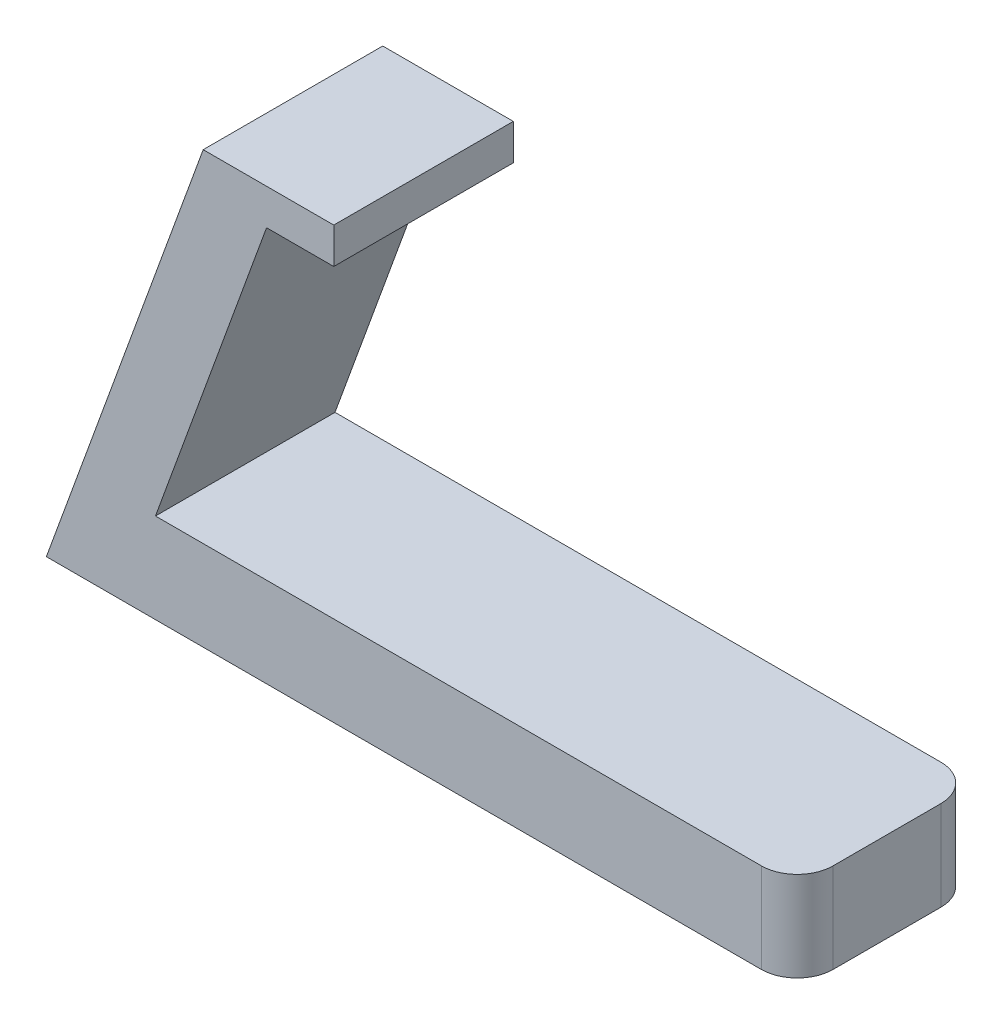
ISO-10303-21;
HEADER;
FILE_DESCRIPTION(('STEP AP214'),'2;1');
FILE_NAME('part.step','',(''),(''),'','','');
FILE_SCHEMA(('AUTOMOTIVE_DESIGN { 1 0 10303 214 1 1 1 1 }'));
ENDSEC;
DATA;
#1=APPLICATION_CONTEXT('core data for automotive mechanical design processes');
#2=APPLICATION_PROTOCOL_DEFINITION('international standard','automotive_design',2000,#1);
#3=PRODUCT_CONTEXT('',#1,'mechanical');
#4=PRODUCT('Part','Part','',(#3));
#5=PRODUCT_RELATED_PRODUCT_CATEGORY('part','',(#4));
#6=PRODUCT_DEFINITION_FORMATION('','',#4);
#7=PRODUCT_DEFINITION_CONTEXT('part definition',#1,'design');
#8=PRODUCT_DEFINITION('design','',#6,#7);
#9=PRODUCT_DEFINITION_SHAPE('','',#8);
#10=(LENGTH_UNIT() NAMED_UNIT(*) SI_UNIT(.MILLI.,.METRE.));
#11=(NAMED_UNIT(*) PLANE_ANGLE_UNIT() SI_UNIT($,.RADIAN.));
#12=(NAMED_UNIT(*) SI_UNIT($,.STERADIAN.) SOLID_ANGLE_UNIT());
#13=UNCERTAINTY_MEASURE_WITH_UNIT(LENGTH_MEASURE(1.E-05),#10,'distance_accuracy_value','');
#14=(GEOMETRIC_REPRESENTATION_CONTEXT(3) GLOBAL_UNCERTAINTY_ASSIGNED_CONTEXT((#13)) GLOBAL_UNIT_ASSIGNED_CONTEXT((#10,
#11,#12)) REPRESENTATION_CONTEXT('',''));
#15=CARTESIAN_POINT('',(0.,0.,0.));
#16=DIRECTION('',(0.,0.,1.));
#17=DIRECTION('',(1.,0.,0.));
#18=AXIS2_PLACEMENT_3D('',#15,#16,#17);
#19=CARTESIAN_POINT('',(0.,6.35,0.));
#20=DIRECTION('',(0.,0.,-1.));
#21=DIRECTION('',(-1.,0.,0.));
#22=AXIS2_PLACEMENT_3D('',#19,#20,#21);
#23=PLANE('',#22);
#24=DIRECTION('',(1.,0.,0.));
#25=VECTOR('',#24,1.);
#26=CARTESIAN_POINT('',(0.,6.35,0.));
#27=LINE('',#26,#25);
#28=CARTESIAN_POINT('',(5.40602308417763,6.35,0.));
#29=VERTEX_POINT('',#28);
#30=CARTESIAN_POINT('',(48.26,6.35,0.));
#31=VERTEX_POINT('',#30);
#32=EDGE_CURVE('E163',#29,#31,#27,.T.);
#33=ORIENTED_EDGE('',*,*,#32,.F.);
#34=DIRECTION('',(0.342020143325666,0.939692620785909,0.));
#35=VECTOR('',#34,1.);
#36=CARTESIAN_POINT('',(3.09481209658727,0.,0.));
#37=LINE('',#36,#35);
#38=CARTESIAN_POINT('',(13.2641404419849,27.94,0.));
#39=VERTEX_POINT('',#38);
#40=EDGE_CURVE('E119',#29,#39,#37,.T.);
#41=ORIENTED_EDGE('',*,*,#40,.T.);
#42=DIRECTION('',(1.,0.,0.));
#43=VECTOR('',#42,1.);
#44=CARTESIAN_POINT('',(7.85811735780723,27.94,0.));
#45=LINE('',#44,#43);
#46=CARTESIAN_POINT('',(18.0181173578072,27.94,0.));
#47=VERTEX_POINT('',#46);
#48=EDGE_CURVE('E112',#39,#47,#45,.T.);
#49=ORIENTED_EDGE('',*,*,#48,.T.);
#50=DIRECTION('',(0.,1.,0.));
#51=VECTOR('',#50,1.);
#52=CARTESIAN_POINT('',(18.0181173578072,27.94,0.));
#53=LINE('',#52,#51);
#54=CARTESIAN_POINT('',(18.0181173578072,30.48,0.));
#55=VERTEX_POINT('',#54);
#56=EDGE_CURVE('E116',#47,#55,#53,.T.);
#57=ORIENTED_EDGE('',*,*,#56,.T.);
#58=DIRECTION('',(-1.,0.,0.));
#59=VECTOR('',#58,1.);
#60=CARTESIAN_POINT('',(18.0181173578072,30.48,0.));
#61=LINE('',#60,#59);
#62=CARTESIAN_POINT('',(8.78260175284337,30.48,0.));
#63=VERTEX_POINT('',#62);
#64=EDGE_CURVE('E132',#55,#63,#61,.T.);
#65=ORIENTED_EDGE('',*,*,#64,.T.);
#66=DIRECTION('',(-0.342020143325666,-0.93969262078591,0.));
#67=VECTOR('',#66,1.);
#68=CARTESIAN_POINT('',(-2.31121098759036,0.,0.));
#69=LINE('',#68,#67);
#70=CARTESIAN_POINT('',(-2.31121098759036,0.,0.));
#71=VERTEX_POINT('',#70);
#72=EDGE_CURVE('E152',#63,#71,#69,.T.);
#73=ORIENTED_EDGE('',*,*,#72,.T.);
#74=DIRECTION('',(1.,0.,0.));
#75=VECTOR('',#74,1.);
#76=CARTESIAN_POINT('',(0.,0.,0.));
#77=LINE('',#76,#75);
#78=CARTESIAN_POINT('',(48.26,0.,0.));
#79=VERTEX_POINT('',#78);
#80=EDGE_CURVE('E162',#71,#79,#77,.T.);
#81=ORIENTED_EDGE('',*,*,#80,.T.);
#82=DIRECTION('',(0.,-1.,0.));
#83=VECTOR('',#82,1.);
#84=CARTESIAN_POINT('',(48.26,6.35,0.));
#85=LINE('',#84,#83);
#86=EDGE_CURVE('E185',#79,#31,#85,.F.);
#87=ORIENTED_EDGE('',*,*,#86,.T.);
#88=EDGE_LOOP('',(#33,#41,#49,#57,#65,#73,#81,#87));
#89=FACE_BOUND('',#88,.T.);
#90=ADVANCED_FACE('F37',(#89),#23,.F.);
#91=CARTESIAN_POINT('',(50.8,6.35,0.));
#92=DIRECTION('',(-1.,0.,0.));
#93=DIRECTION('',(0.,0.,1.));
#94=AXIS2_PLACEMENT_3D('',#91,#92,#93);
#95=PLANE('',#94);
#96=DIRECTION('',(0.,0.,-1.));
#97=VECTOR('',#96,1.);
#98=CARTESIAN_POINT('',(50.8,6.35,0.));
#99=LINE('',#98,#97);
#100=CARTESIAN_POINT('',(50.8,6.35,-2.54));
#101=VERTEX_POINT('',#100);
#102=CARTESIAN_POINT('',(50.8,6.35,-10.16));
#103=VERTEX_POINT('',#102);
#104=EDGE_CURVE('E165',#101,#103,#99,.T.);
#105=ORIENTED_EDGE('',*,*,#104,.F.);
#106=DIRECTION('',(0.,-1.,0.));
#107=VECTOR('',#106,1.);
#108=CARTESIAN_POINT('',(50.8,6.35,-2.54));
#109=LINE('',#108,#107);
#110=CARTESIAN_POINT('',(50.8,0.,-2.54));
#111=VERTEX_POINT('',#110);
#112=EDGE_CURVE('E177',#101,#111,#109,.T.);
#113=ORIENTED_EDGE('',*,*,#112,.T.);
#114=DIRECTION('',(0.,0.,-1.));
#115=VECTOR('',#114,1.);
#116=CARTESIAN_POINT('',(50.8,0.,0.));
#117=LINE('',#116,#115);
#118=CARTESIAN_POINT('',(50.8,0.,-10.16));
#119=VERTEX_POINT('',#118);
#120=EDGE_CURVE('E172',#111,#119,#117,.T.);
#121=ORIENTED_EDGE('',*,*,#120,.T.);
#122=DIRECTION('',(0.,-1.,0.));
#123=VECTOR('',#122,1.);
#124=CARTESIAN_POINT('',(50.8,6.35,-10.16));
#125=LINE('',#124,#123);
#126=EDGE_CURVE('E170',#119,#103,#125,.F.);
#127=ORIENTED_EDGE('',*,*,#126,.T.);
#128=EDGE_LOOP('',(#105,#113,#121,#127));
#129=FACE_BOUND('',#128,.T.);
#130=ADVANCED_FACE('F197',(#129),#95,.F.);
#131=CARTESIAN_POINT('',(0.,6.35,-12.7));
#132=DIRECTION('',(0.,0.,1.));
#133=DIRECTION('',(1.,0.,0.));
#134=AXIS2_PLACEMENT_3D('',#131,#132,#133);
#135=PLANE('',#134);
#136=DIRECTION('',(-1.,0.,0.));
#137=VECTOR('',#136,1.);
#138=CARTESIAN_POINT('',(0.,0.,-12.7));
#139=LINE('',#138,#137);
#140=CARTESIAN_POINT('',(48.26,0.,-12.7));
#141=VERTEX_POINT('',#140);
#142=CARTESIAN_POINT('',(-2.31121098759036,0.,-12.7));
#143=VERTEX_POINT('',#142);
#144=EDGE_CURVE('E166',#141,#143,#139,.T.);
#145=ORIENTED_EDGE('',*,*,#144,.T.);
#146=DIRECTION('',(0.342020143325666,0.93969262078591,0.));
#147=VECTOR('',#146,1.);
#148=CARTESIAN_POINT('',(-2.31121098759036,0.,-12.7));
#149=LINE('',#148,#147);
#150=CARTESIAN_POINT('',(8.78260175284337,30.48,-12.7));
#151=VERTEX_POINT('',#150);
#152=EDGE_CURVE('E147',#143,#151,#149,.T.);
#153=ORIENTED_EDGE('',*,*,#152,.T.);
#154=DIRECTION('',(1.,0.,0.));
#155=VECTOR('',#154,1.);
#156=CARTESIAN_POINT('',(18.0181173578072,30.48,-12.7));
#157=LINE('',#156,#155);
#158=CARTESIAN_POINT('',(18.0181173578072,30.48,-12.7));
#159=VERTEX_POINT('',#158);
#160=EDGE_CURVE('E146',#151,#159,#157,.T.);
#161=ORIENTED_EDGE('',*,*,#160,.T.);
#162=DIRECTION('',(0.,-1.,0.));
#163=VECTOR('',#162,1.);
#164=CARTESIAN_POINT('',(18.0181173578072,27.94,-12.7));
#165=LINE('',#164,#163);
#166=CARTESIAN_POINT('',(18.0181173578072,27.94,-12.7));
#167=VERTEX_POINT('',#166);
#168=EDGE_CURVE('E143',#159,#167,#165,.T.);
#169=ORIENTED_EDGE('',*,*,#168,.T.);
#170=DIRECTION('',(-1.,0.,0.));
#171=VECTOR('',#170,1.);
#172=CARTESIAN_POINT('',(7.85811735780723,27.94,-12.7));
#173=LINE('',#172,#171);
#174=CARTESIAN_POINT('',(13.2641404419849,27.94,-12.7));
#175=VERTEX_POINT('',#174);
#176=EDGE_CURVE('E128',#167,#175,#173,.T.);
#177=ORIENTED_EDGE('',*,*,#176,.T.);
#178=DIRECTION('',(-0.342020143325666,-0.93969262078591,0.));
#179=VECTOR('',#178,1.);
#180=CARTESIAN_POINT('',(3.09481209658727,0.,-12.7));
#181=LINE('',#180,#179);
#182=CARTESIAN_POINT('',(5.40602308417763,6.35,-12.7));
#183=VERTEX_POINT('',#182);
#184=EDGE_CURVE('E149',#175,#183,#181,.T.);
#185=ORIENTED_EDGE('',*,*,#184,.T.);
#186=DIRECTION('',(-1.,0.,0.));
#187=VECTOR('',#186,1.);
#188=CARTESIAN_POINT('',(0.,6.35,-12.7));
#189=LINE('',#188,#187);
#190=CARTESIAN_POINT('',(48.26,6.35,-12.7));
#191=VERTEX_POINT('',#190);
#192=EDGE_CURVE('E52',#191,#183,#189,.T.);
#193=ORIENTED_EDGE('',*,*,#192,.F.);
#194=DIRECTION('',(0.,-1.,0.));
#195=VECTOR('',#194,1.);
#196=CARTESIAN_POINT('',(48.26,6.35,-12.7));
#197=LINE('',#196,#195);
#198=EDGE_CURVE('E11',#191,#141,#197,.T.);
#199=ORIENTED_EDGE('',*,*,#198,.T.);
#200=EDGE_LOOP('',(#145,#153,#161,#169,#177,#185,#193,#199));
#201=FACE_BOUND('',#200,.T.);
#202=ADVANCED_FACE('F208',(#201),#135,.F.);
#203=CARTESIAN_POINT('',(0.,6.35,0.));
#204=DIRECTION('',(0.,-1.,0.));
#205=DIRECTION('',(0.,0.,-1.));
#206=AXIS2_PLACEMENT_3D('',#203,#204,#205);
#207=PLANE('',#206);
#208=ORIENTED_EDGE('',*,*,#192,.T.);
#209=DIRECTION('',(0.,0.,1.));
#210=VECTOR('',#209,1.);
#211=CARTESIAN_POINT('',(5.40602308417763,6.35,0.));
#212=LINE('',#211,#210);
#213=EDGE_CURVE('E56',#183,#29,#212,.T.);
#214=ORIENTED_EDGE('',*,*,#213,.T.);
#215=ORIENTED_EDGE('',*,*,#32,.T.);
#216=CARTESIAN_POINT('',(48.26,6.35,-2.54));
#217=DIRECTION('',(0.,-1.,0.));
#218=DIRECTION('',(0.,0.,-1.));
#219=AXIS2_PLACEMENT_3D('',#216,#217,#218);
#220=CIRCLE('',#219,2.54);
#221=EDGE_CURVE('E45',#31,#101,#220,.F.);
#222=ORIENTED_EDGE('',*,*,#221,.T.);
#223=ORIENTED_EDGE('',*,*,#104,.T.);
#224=CARTESIAN_POINT('',(48.26,6.35,-10.16));
#225=DIRECTION('',(0.,-1.,0.));
#226=DIRECTION('',(0.,0.,-1.));
#227=AXIS2_PLACEMENT_3D('',#224,#225,#226);
#228=CIRCLE('',#227,2.54);
#229=EDGE_CURVE('E188',#103,#191,#228,.F.);
#230=ORIENTED_EDGE('',*,*,#229,.T.);
#231=EDGE_LOOP('',(#208,#214,#215,#222,#223,#230));
#232=FACE_BOUND('',#231,.T.);
#233=ADVANCED_FACE('F191',(#232),#207,.F.);
#234=CARTESIAN_POINT('',(0.,0.,0.));
#235=DIRECTION('',(0.,-1.,0.));
#236=DIRECTION('',(0.,0.,-1.));
#237=AXIS2_PLACEMENT_3D('',#234,#235,#236);
#238=PLANE('',#237);
#239=CARTESIAN_POINT('',(48.26,0.,-2.54));
#240=DIRECTION('',(0.,-1.,0.));
#241=DIRECTION('',(0.,0.,-1.));
#242=AXIS2_PLACEMENT_3D('',#239,#240,#241);
#243=CIRCLE('',#242,2.54);
#244=EDGE_CURVE('E182',#111,#79,#243,.T.);
#245=ORIENTED_EDGE('',*,*,#244,.T.);
#246=ORIENTED_EDGE('',*,*,#80,.F.);
#247=DIRECTION('',(0.,0.,1.));
#248=VECTOR('',#247,1.);
#249=CARTESIAN_POINT('',(-2.31121098759036,0.,-44.688047332633));
#250=LINE('',#249,#248);
#251=EDGE_CURVE('E150',#143,#71,#250,.T.);
#252=ORIENTED_EDGE('',*,*,#251,.F.);
#253=ORIENTED_EDGE('',*,*,#144,.F.);
#254=CARTESIAN_POINT('',(48.26,0.,-10.16));
#255=DIRECTION('',(0.,-1.,0.));
#256=DIRECTION('',(0.,0.,-1.));
#257=AXIS2_PLACEMENT_3D('',#254,#255,#256);
#258=CIRCLE('',#257,2.54);
#259=EDGE_CURVE('E180',#141,#119,#258,.T.);
#260=ORIENTED_EDGE('',*,*,#259,.T.);
#261=ORIENTED_EDGE('',*,*,#120,.F.);
#262=EDGE_LOOP('',(#245,#246,#252,#253,#260,#261));
#263=FACE_BOUND('',#262,.T.);
#264=ADVANCED_FACE('F202',(#263),#238,.T.);
#265=CARTESIAN_POINT('',(48.26,6.35,-2.54));
#266=DIRECTION('',(0.,-1.,0.));
#267=DIRECTION('',(0.,0.,-1.));
#268=AXIS2_PLACEMENT_3D('',#265,#266,#267);
#269=CYLINDRICAL_SURFACE('',#268,2.54);
#270=ORIENTED_EDGE('',*,*,#221,.F.);
#271=ORIENTED_EDGE('',*,*,#86,.F.);
#272=ORIENTED_EDGE('',*,*,#244,.F.);
#273=ORIENTED_EDGE('',*,*,#112,.F.);
#274=EDGE_LOOP('',(#270,#271,#272,#273));
#275=FACE_BOUND('',#274,.T.);
#276=ADVANCED_FACE('F200',(#275),#269,.T.);
#277=CARTESIAN_POINT('',(48.26,6.35,-10.16));
#278=DIRECTION('',(0.,-1.,0.));
#279=DIRECTION('',(0.,0.,-1.));
#280=AXIS2_PLACEMENT_3D('',#277,#278,#279);
#281=CYLINDRICAL_SURFACE('',#280,2.54);
#282=ORIENTED_EDGE('',*,*,#229,.F.);
#283=ORIENTED_EDGE('',*,*,#126,.F.);
#284=ORIENTED_EDGE('',*,*,#259,.F.);
#285=ORIENTED_EDGE('',*,*,#198,.F.);
#286=EDGE_LOOP('',(#282,#283,#284,#285));
#287=FACE_BOUND('',#286,.T.);
#288=ADVANCED_FACE('F39',(#287),#281,.T.);
#289=CARTESIAN_POINT('',(-2.31121098759036,0.,-44.688047332633));
#290=DIRECTION('',(-0.939692620785909,0.342020143325666,0.));
#291=DIRECTION('',(-0.342020143325666,-0.93969262078591,0.));
#292=AXIS2_PLACEMENT_3D('',#289,#290,#291);
#293=PLANE('',#292);
#294=ORIENTED_EDGE('',*,*,#72,.F.);
#295=DIRECTION('',(0.,0.,1.));
#296=VECTOR('',#295,1.);
#297=CARTESIAN_POINT('',(8.78260175284337,30.48,-23.1726882890689));
#298=LINE('',#297,#296);
#299=EDGE_CURVE('E140',#151,#63,#298,.T.);
#300=ORIENTED_EDGE('',*,*,#299,.F.);
#301=ORIENTED_EDGE('',*,*,#152,.F.);
#302=ORIENTED_EDGE('',*,*,#251,.T.);
#303=EDGE_LOOP('',(#294,#300,#301,#302));
#304=FACE_BOUND('',#303,.T.);
#305=ADVANCED_FACE('F213',(#304),#293,.T.);
#306=CARTESIAN_POINT('',(3.09481209658727,0.,-44.688047332633));
#307=DIRECTION('',(0.939692620785909,-0.342020143325666,0.));
#308=DIRECTION('',(0.342020143325666,0.93969262078591,0.));
#309=AXIS2_PLACEMENT_3D('',#306,#307,#308);
#310=PLANE('',#309);
#311=ORIENTED_EDGE('',*,*,#213,.F.);
#312=ORIENTED_EDGE('',*,*,#184,.F.);
#313=DIRECTION('',(0.,0.,1.));
#314=VECTOR('',#313,1.);
#315=CARTESIAN_POINT('',(13.2641404419849,27.94,-44.688047332633));
#316=LINE('',#315,#314);
#317=EDGE_CURVE('E155',#175,#39,#316,.T.);
#318=ORIENTED_EDGE('',*,*,#317,.T.);
#319=ORIENTED_EDGE('',*,*,#40,.F.);
#320=EDGE_LOOP('',(#311,#312,#318,#319));
#321=FACE_BOUND('',#320,.T.);
#322=ADVANCED_FACE('F211',(#321),#310,.T.);
#323=CARTESIAN_POINT('',(7.85811735780723,27.94,-23.1726882890689));
#324=DIRECTION('',(0.,-1.,0.));
#325=DIRECTION('',(0.,0.,-1.));
#326=AXIS2_PLACEMENT_3D('',#323,#324,#325);
#327=PLANE('',#326);
#328=ORIENTED_EDGE('',*,*,#317,.F.);
#329=ORIENTED_EDGE('',*,*,#176,.F.);
#330=DIRECTION('',(0.,0.,1.));
#331=VECTOR('',#330,1.);
#332=CARTESIAN_POINT('',(18.0181173578072,27.94,-23.1726882890689));
#333=LINE('',#332,#331);
#334=EDGE_CURVE('E125',#167,#47,#333,.T.);
#335=ORIENTED_EDGE('',*,*,#334,.T.);
#336=ORIENTED_EDGE('',*,*,#48,.F.);
#337=EDGE_LOOP('',(#328,#329,#335,#336));
#338=FACE_BOUND('',#337,.T.);
#339=ADVANCED_FACE('F126',(#338),#327,.T.);
#340=CARTESIAN_POINT('',(18.0181173578072,30.48,-23.1726882890689));
#341=DIRECTION('',(0.,1.,0.));
#342=DIRECTION('',(0.,0.,1.));
#343=AXIS2_PLACEMENT_3D('',#340,#341,#342);
#344=PLANE('',#343);
#345=ORIENTED_EDGE('',*,*,#160,.F.);
#346=ORIENTED_EDGE('',*,*,#299,.T.);
#347=ORIENTED_EDGE('',*,*,#64,.F.);
#348=DIRECTION('',(0.,0.,1.));
#349=VECTOR('',#348,1.);
#350=CARTESIAN_POINT('',(18.0181173578072,30.48,-23.1726882890689));
#351=LINE('',#350,#349);
#352=EDGE_CURVE('E131',#159,#55,#351,.T.);
#353=ORIENTED_EDGE('',*,*,#352,.F.);
#354=EDGE_LOOP('',(#345,#346,#347,#353));
#355=FACE_BOUND('',#354,.T.);
#356=ADVANCED_FACE('F219',(#355),#344,.T.);
#357=CARTESIAN_POINT('',(18.0181173578072,27.94,-23.1726882890689));
#358=DIRECTION('',(1.,0.,0.));
#359=DIRECTION('',(0.,0.,-1.));
#360=AXIS2_PLACEMENT_3D('',#357,#358,#359);
#361=PLANE('',#360);
#362=ORIENTED_EDGE('',*,*,#168,.F.);
#363=ORIENTED_EDGE('',*,*,#352,.T.);
#364=ORIENTED_EDGE('',*,*,#56,.F.);
#365=ORIENTED_EDGE('',*,*,#334,.F.);
#366=EDGE_LOOP('',(#362,#363,#364,#365));
#367=FACE_BOUND('',#366,.T.);
#368=ADVANCED_FACE('F134',(#367),#361,.T.);
#369=CLOSED_SHELL('',(#90,#130,#202,#233,#264,#276,#288,#305,#322,#339,#356,#368));
#370=MANIFOLD_SOLID_BREP('B2',#369);
#371=ADVANCED_BREP_SHAPE_REPRESENTATION('',(#18,#370),#14);
#372=SHAPE_DEFINITION_REPRESENTATION(#9,#371);
ENDSEC;
END-ISO-10303-21;
